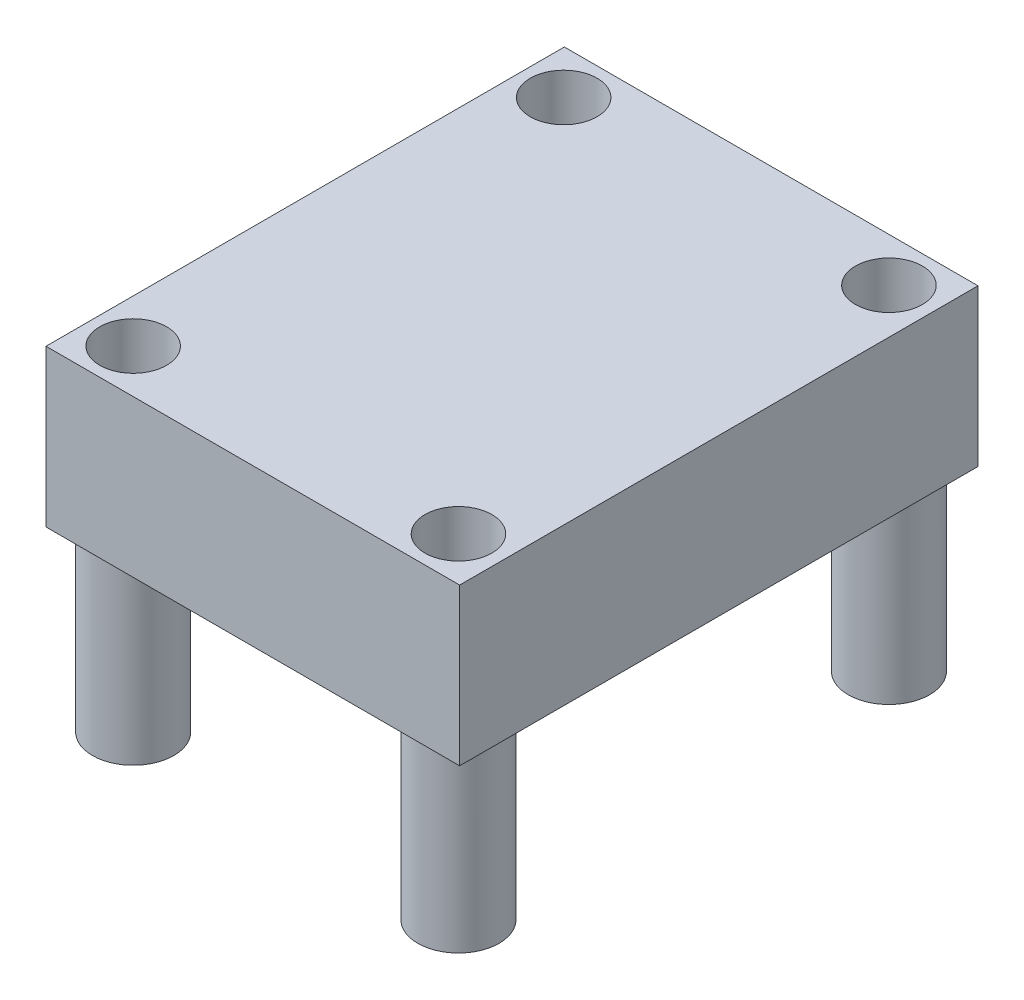
ISO-10303-21;
HEADER;
FILE_DESCRIPTION(('STEP AP214'),'2;1');
FILE_NAME('part.step','',(''),(''),'','','');
FILE_SCHEMA(('AUTOMOTIVE_DESIGN { 1 0 10303 214 1 1 1 1 }'));
ENDSEC;
DATA;
#1=APPLICATION_CONTEXT('core data for automotive mechanical design processes');
#2=APPLICATION_PROTOCOL_DEFINITION('international standard','automotive_design',2000,#1);
#3=PRODUCT_CONTEXT('',#1,'mechanical');
#4=PRODUCT('Part','Part','',(#3));
#5=PRODUCT_RELATED_PRODUCT_CATEGORY('part','',(#4));
#6=PRODUCT_DEFINITION_FORMATION('','',#4);
#7=PRODUCT_DEFINITION_CONTEXT('part definition',#1,'design');
#8=PRODUCT_DEFINITION('design','',#6,#7);
#9=PRODUCT_DEFINITION_SHAPE('','',#8);
#10=(LENGTH_UNIT() NAMED_UNIT(*) SI_UNIT(.MILLI.,.METRE.));
#11=(NAMED_UNIT(*) PLANE_ANGLE_UNIT() SI_UNIT($,.RADIAN.));
#12=(NAMED_UNIT(*) SI_UNIT($,.STERADIAN.) SOLID_ANGLE_UNIT());
#13=UNCERTAINTY_MEASURE_WITH_UNIT(LENGTH_MEASURE(1.E-05),#10,'distance_accuracy_value','');
#14=(GEOMETRIC_REPRESENTATION_CONTEXT(3) GLOBAL_UNCERTAINTY_ASSIGNED_CONTEXT((#13)) GLOBAL_UNIT_ASSIGNED_CONTEXT((#10,
#11,#12)) REPRESENTATION_CONTEXT('',''));
#15=CARTESIAN_POINT('',(0.,0.,0.));
#16=DIRECTION('',(0.,0.,1.));
#17=DIRECTION('',(1.,0.,0.));
#18=AXIS2_PLACEMENT_3D('',#15,#16,#17);
#19=CARTESIAN_POINT('',(-9.13941883767535,7.6708,-8.06299839679359));
#20=DIRECTION('',(1.,0.,0.));
#21=DIRECTION('',(0.,0.,-1.));
#22=AXIS2_PLACEMENT_3D('',#19,#20,#21);
#23=PLANE('',#22);
#24=DIRECTION('',(0.,0.,1.));
#25=VECTOR('',#24,1.);
#26=CARTESIAN_POINT('',(-9.13941883767535,0.,-8.06299839679359));
#27=LINE('',#26,#25);
#28=CARTESIAN_POINT('',(-9.13941883767535,0.,-8.06299839679359));
#29=VERTEX_POINT('',#28);
#30=CARTESIAN_POINT('',(-9.13941883767534,0.,17.3370016032064));
#31=VERTEX_POINT('',#30);
#32=EDGE_CURVE('E106',#29,#31,#27,.T.);
#33=ORIENTED_EDGE('',*,*,#32,.T.);
#34=DIRECTION('',(0.,-1.,0.));
#35=VECTOR('',#34,1.);
#36=CARTESIAN_POINT('',(-9.13941883767534,7.6708,17.3370016032064));
#37=LINE('',#36,#35);
#38=CARTESIAN_POINT('',(-9.13941883767534,7.6708,17.3370016032064));
#39=VERTEX_POINT('',#38);
#40=EDGE_CURVE('E97',#39,#31,#37,.T.);
#41=ORIENTED_EDGE('',*,*,#40,.F.);
#42=DIRECTION('',(0.,0.,1.));
#43=VECTOR('',#42,1.);
#44=CARTESIAN_POINT('',(-9.13941883767535,7.6708,-8.06299839679359));
#45=LINE('',#44,#43);
#46=CARTESIAN_POINT('',(-9.13941883767535,7.6708,-8.06299839679359));
#47=VERTEX_POINT('',#46);
#48=EDGE_CURVE('E91',#47,#39,#45,.T.);
#49=ORIENTED_EDGE('',*,*,#48,.F.);
#50=DIRECTION('',(0.,-1.,0.));
#51=VECTOR('',#50,1.);
#52=CARTESIAN_POINT('',(-9.13941883767535,7.6708,-8.06299839679359));
#53=LINE('',#52,#51);
#54=EDGE_CURVE('E102',#47,#29,#53,.T.);
#55=ORIENTED_EDGE('',*,*,#54,.T.);
#56=EDGE_LOOP('',(#33,#41,#49,#55));
#57=FACE_BOUND('',#56,.T.);
#58=ADVANCED_FACE('F39',(#57),#23,.F.);
#59=CARTESIAN_POINT('',(-9.13941883767534,7.6708,17.3370016032064));
#60=DIRECTION('',(0.,0.,-1.));
#61=DIRECTION('',(-1.,0.,0.));
#62=AXIS2_PLACEMENT_3D('',#59,#60,#61);
#63=PLANE('',#62);
#64=DIRECTION('',(1.,0.,0.));
#65=VECTOR('',#64,1.);
#66=CARTESIAN_POINT('',(-9.13941883767534,0.,17.3370016032064));
#67=LINE('',#66,#65);
#68=CARTESIAN_POINT('',(11.1297811623247,0.,17.3370016032064));
#69=VERTEX_POINT('',#68);
#70=EDGE_CURVE('E96',#31,#69,#67,.T.);
#71=ORIENTED_EDGE('',*,*,#70,.T.);
#72=DIRECTION('',(0.,-1.,0.));
#73=VECTOR('',#72,1.);
#74=CARTESIAN_POINT('',(11.1297811623247,7.6708,17.3370016032064));
#75=LINE('',#74,#73);
#76=CARTESIAN_POINT('',(11.1297811623247,7.6708,17.3370016032064));
#77=VERTEX_POINT('',#76);
#78=EDGE_CURVE('E94',#77,#69,#75,.T.);
#79=ORIENTED_EDGE('',*,*,#78,.F.);
#80=DIRECTION('',(1.,0.,0.));
#81=VECTOR('',#80,1.);
#82=CARTESIAN_POINT('',(-9.13941883767534,7.6708,17.3370016032064));
#83=LINE('',#82,#81);
#84=EDGE_CURVE('E86',#39,#77,#83,.T.);
#85=ORIENTED_EDGE('',*,*,#84,.F.);
#86=ORIENTED_EDGE('',*,*,#40,.T.);
#87=EDGE_LOOP('',(#71,#79,#85,#86));
#88=FACE_BOUND('',#87,.T.);
#89=ADVANCED_FACE('F95',(#88),#63,.F.);
#90=CARTESIAN_POINT('',(11.1297811623247,7.6708,-8.06299839679359));
#91=DIRECTION('',(-1.,0.,0.));
#92=DIRECTION('',(0.,0.,1.));
#93=AXIS2_PLACEMENT_3D('',#90,#91,#92);
#94=PLANE('',#93);
#95=DIRECTION('',(0.,0.,-1.));
#96=VECTOR('',#95,1.);
#97=CARTESIAN_POINT('',(11.1297811623247,0.,-8.06299839679359));
#98=LINE('',#97,#96);
#99=CARTESIAN_POINT('',(11.1297811623247,0.,-8.06299839679359));
#100=VERTEX_POINT('',#99);
#101=EDGE_CURVE('E72',#69,#100,#98,.T.);
#102=ORIENTED_EDGE('',*,*,#101,.T.);
#103=DIRECTION('',(0.,-1.,0.));
#104=VECTOR('',#103,1.);
#105=CARTESIAN_POINT('',(11.1297811623247,7.6708,-8.06299839679359));
#106=LINE('',#105,#104);
#107=CARTESIAN_POINT('',(11.1297811623247,7.6708,-8.06299839679359));
#108=VERTEX_POINT('',#107);
#109=EDGE_CURVE('E98',#108,#100,#106,.T.);
#110=ORIENTED_EDGE('',*,*,#109,.F.);
#111=DIRECTION('',(0.,0.,-1.));
#112=VECTOR('',#111,1.);
#113=CARTESIAN_POINT('',(11.1297811623247,7.6708,-8.06299839679359));
#114=LINE('',#113,#112);
#115=EDGE_CURVE('E89',#77,#108,#114,.T.);
#116=ORIENTED_EDGE('',*,*,#115,.F.);
#117=ORIENTED_EDGE('',*,*,#78,.T.);
#118=EDGE_LOOP('',(#102,#110,#116,#117));
#119=FACE_BOUND('',#118,.T.);
#120=ADVANCED_FACE('F100',(#119),#94,.F.);
#121=CARTESIAN_POINT('',(-9.13941883767535,7.6708,-8.06299839679359));
#122=DIRECTION('',(0.,0.,1.));
#123=DIRECTION('',(1.,0.,0.));
#124=AXIS2_PLACEMENT_3D('',#121,#122,#123);
#125=PLANE('',#124);
#126=DIRECTION('',(-1.,0.,0.));
#127=VECTOR('',#126,1.);
#128=CARTESIAN_POINT('',(-9.13941883767535,0.,-8.06299839679359));
#129=LINE('',#128,#127);
#130=EDGE_CURVE('E78',#100,#29,#129,.T.);
#131=ORIENTED_EDGE('',*,*,#130,.T.);
#132=ORIENTED_EDGE('',*,*,#54,.F.);
#133=DIRECTION('',(-1.,0.,0.));
#134=VECTOR('',#133,1.);
#135=CARTESIAN_POINT('',(-9.13941883767535,7.6708,-8.06299839679359));
#136=LINE('',#135,#134);
#137=EDGE_CURVE('E55',#108,#47,#136,.T.);
#138=ORIENTED_EDGE('',*,*,#137,.F.);
#139=ORIENTED_EDGE('',*,*,#109,.T.);
#140=EDGE_LOOP('',(#131,#132,#138,#139));
#141=FACE_BOUND('',#140,.T.);
#142=ADVANCED_FACE('F138',(#141),#125,.F.);
#143=CARTESIAN_POINT('',(0.,7.6708,0.));
#144=DIRECTION('',(0.,1.,0.));
#145=DIRECTION('',(0.,0.,1.));
#146=AXIS2_PLACEMENT_3D('',#143,#144,#145);
#147=PLANE('',#146);
#148=CARTESIAN_POINT('',(-7.01266761022166,7.6708,-5.90251142136091));
#149=DIRECTION('',(0.,1.,0.));
#150=DIRECTION('',(0.,0.,1.));
#151=AXIS2_PLACEMENT_3D('',#148,#149,#150);
#152=CIRCLE('',#151,1.6383);
#153=CARTESIAN_POINT('',(-7.01266761022166,7.6708,-4.2642114213609));
#154=VERTEX_POINT('',#153);
#155=EDGE_CURVE('E356',#154,#154,#152,.T.);
#156=ORIENTED_EDGE('',*,*,#155,.F.);
#157=EDGE_LOOP('',(#156));
#158=FACE_BOUND('',#157,.T.);
#159=CARTESIAN_POINT('',(8.92513257327033,7.6708,15.1920941000938));
#160=DIRECTION('',(0.,1.,0.));
#161=DIRECTION('',(0.,0.,1.));
#162=AXIS2_PLACEMENT_3D('',#159,#160,#161);
#163=CIRCLE('',#162,1.6383);
#164=CARTESIAN_POINT('',(8.92513257327033,7.6708,16.8303941000938));
#165=VERTEX_POINT('',#164);
#166=EDGE_CURVE('E358',#165,#165,#163,.T.);
#167=ORIENTED_EDGE('',*,*,#166,.F.);
#168=EDGE_LOOP('',(#167));
#169=FACE_BOUND('',#168,.T.);
#170=CARTESIAN_POINT('',(-7.01266761022166,7.6708,15.1920941000938));
#171=DIRECTION('',(0.,1.,0.));
#172=DIRECTION('',(0.,0.,1.));
#173=AXIS2_PLACEMENT_3D('',#170,#171,#172);
#174=CIRCLE('',#173,1.6383);
#175=CARTESIAN_POINT('',(-7.01266761022166,7.6708,16.8303941000938));
#176=VERTEX_POINT('',#175);
#177=EDGE_CURVE('E364',#176,#176,#174,.T.);
#178=ORIENTED_EDGE('',*,*,#177,.F.);
#179=EDGE_LOOP('',(#178));
#180=FACE_BOUND('',#179,.T.);
#181=CARTESIAN_POINT('',(8.92513257327033,7.6708,-5.90251142136091));
#182=DIRECTION('',(0.,1.,0.));
#183=DIRECTION('',(0.,0.,1.));
#184=AXIS2_PLACEMENT_3D('',#181,#182,#183);
#185=CIRCLE('',#184,1.6383);
#186=CARTESIAN_POINT('',(8.92513257327033,7.6708,-4.2642114213609));
#187=VERTEX_POINT('',#186);
#188=EDGE_CURVE('E357',#187,#187,#185,.T.);
#189=ORIENTED_EDGE('',*,*,#188,.F.);
#190=EDGE_LOOP('',(#189));
#191=FACE_BOUND('',#190,.T.);
#192=ORIENTED_EDGE('',*,*,#48,.T.);
#193=ORIENTED_EDGE('',*,*,#84,.T.);
#194=ORIENTED_EDGE('',*,*,#115,.T.);
#195=ORIENTED_EDGE('',*,*,#137,.T.);
#196=EDGE_LOOP('',(#192,#193,#194,#195));
#197=FACE_BOUND('',#196,.T.);
#198=ADVANCED_FACE('F87',(#158,#169,#180,#191,#197),#147,.T.);
#199=CARTESIAN_POINT('',(0.,0.,0.));
#200=DIRECTION('',(0.,1.,0.));
#201=DIRECTION('',(0.,0.,1.));
#202=AXIS2_PLACEMENT_3D('',#199,#200,#201);
#203=PLANE('',#202);
#204=CARTESIAN_POINT('',(-7.01266761022166,0.,-5.90251142136091));
#205=DIRECTION('',(0.,1.,0.));
#206=DIRECTION('',(0.,0.,1.));
#207=AXIS2_PLACEMENT_3D('',#204,#205,#206);
#208=CIRCLE('',#207,1.9939);
#209=CARTESIAN_POINT('',(-7.01266761022166,0.,-3.90861142136091));
#210=VERTEX_POINT('',#209);
#211=EDGE_CURVE('E11',#210,#210,#208,.F.);
#212=ORIENTED_EDGE('',*,*,#211,.F.);
#213=EDGE_LOOP('',(#212));
#214=FACE_BOUND('',#213,.T.);
#215=CARTESIAN_POINT('',(8.92513257327033,0.,-5.90251142136091));
#216=DIRECTION('',(0.,1.,0.));
#217=DIRECTION('',(0.,0.,1.));
#218=AXIS2_PLACEMENT_3D('',#215,#216,#217);
#219=CIRCLE('',#218,1.9939);
#220=CARTESIAN_POINT('',(8.92513257327033,0.,-3.90861142136091));
#221=VERTEX_POINT('',#220);
#222=EDGE_CURVE('E47',#221,#221,#219,.F.);
#223=ORIENTED_EDGE('',*,*,#222,.F.);
#224=EDGE_LOOP('',(#223));
#225=FACE_BOUND('',#224,.T.);
#226=CARTESIAN_POINT('',(8.92513257327033,0.,15.1920941000938));
#227=DIRECTION('',(0.,1.,0.));
#228=DIRECTION('',(0.,0.,1.));
#229=AXIS2_PLACEMENT_3D('',#226,#227,#228);
#230=CIRCLE('',#229,1.9939);
#231=CARTESIAN_POINT('',(8.92513257327033,0.,17.1859941000938));
#232=VERTEX_POINT('',#231);
#233=EDGE_CURVE('E119',#232,#232,#230,.F.);
#234=ORIENTED_EDGE('',*,*,#233,.F.);
#235=EDGE_LOOP('',(#234));
#236=FACE_BOUND('',#235,.T.);
#237=CARTESIAN_POINT('',(-7.01266761022166,0.,15.1920941000938));
#238=DIRECTION('',(0.,1.,0.));
#239=DIRECTION('',(0.,0.,1.));
#240=AXIS2_PLACEMENT_3D('',#237,#238,#239);
#241=CIRCLE('',#240,1.9939);
#242=CARTESIAN_POINT('',(-7.01266761022166,0.,17.1859941000938));
#243=VERTEX_POINT('',#242);
#244=EDGE_CURVE('E116',#243,#243,#241,.F.);
#245=ORIENTED_EDGE('',*,*,#244,.F.);
#246=EDGE_LOOP('',(#245));
#247=FACE_BOUND('',#246,.T.);
#248=ORIENTED_EDGE('',*,*,#32,.F.);
#249=ORIENTED_EDGE('',*,*,#130,.F.);
#250=ORIENTED_EDGE('',*,*,#101,.F.);
#251=ORIENTED_EDGE('',*,*,#70,.F.);
#252=EDGE_LOOP('',(#248,#249,#250,#251));
#253=FACE_BOUND('',#252,.T.);
#254=ADVANCED_FACE('F126',(#214,#225,#236,#247,#253),#203,.F.);
#255=CARTESIAN_POINT('',(-7.01266761022166,-8.7122,15.1920941000938));
#256=DIRECTION('',(0.,-1.,0.));
#257=DIRECTION('',(0.,0.,-1.));
#258=AXIS2_PLACEMENT_3D('',#255,#256,#257);
#259=PLANE('',#258);
#260=CARTESIAN_POINT('',(-7.01266761022166,-8.7122,15.1920941000938));
#261=DIRECTION('',(0.,-1.,0.));
#262=DIRECTION('',(0.,0.,-1.));
#263=AXIS2_PLACEMENT_3D('',#260,#261,#262);
#264=CIRCLE('',#263,1.9939);
#265=CARTESIAN_POINT('',(-7.01266761022166,-8.7122,13.1981941000938));
#266=VERTEX_POINT('',#265);
#267=EDGE_CURVE('E109',#266,#266,#264,.T.);
#268=ORIENTED_EDGE('',*,*,#267,.T.);
#269=EDGE_LOOP('',(#268));
#270=FACE_BOUND('',#269,.T.);
#271=CARTESIAN_POINT('',(-7.01266761022166,-8.7122,15.1920941000938));
#272=DIRECTION('',(0.,-1.,0.));
#273=DIRECTION('',(0.,0.,-1.));
#274=AXIS2_PLACEMENT_3D('',#271,#272,#273);
#275=CIRCLE('',#274,1.6383);
#276=CARTESIAN_POINT('',(-7.01266761022166,-8.7122,13.5537941000938));
#277=VERTEX_POINT('',#276);
#278=EDGE_CURVE('E383',#277,#277,#275,.T.);
#279=ORIENTED_EDGE('',*,*,#278,.F.);
#280=EDGE_LOOP('',(#279));
#281=FACE_BOUND('',#280,.T.);
#282=ADVANCED_FACE('F129',(#270,#281),#259,.T.);
#283=CARTESIAN_POINT('',(-7.01266761022166,-8.7122,15.1920941000938));
#284=DIRECTION('',(0.,1.,0.));
#285=DIRECTION('',(0.,0.,1.));
#286=AXIS2_PLACEMENT_3D('',#283,#284,#285);
#287=CYLINDRICAL_SURFACE('',#286,1.9939);
#288=ORIENTED_EDGE('',*,*,#267,.F.);
#289=EDGE_LOOP('',(#288));
#290=FACE_BOUND('',#289,.T.);
#291=ORIENTED_EDGE('',*,*,#244,.T.);
#292=EDGE_LOOP('',(#291));
#293=FACE_BOUND('',#292,.T.);
#294=ADVANCED_FACE('F181',(#290,#293),#287,.T.);
#295=CARTESIAN_POINT('',(-7.01266761022166,-8.7122,15.1920941000938));
#296=DIRECTION('',(0.,1.,0.));
#297=DIRECTION('',(0.,0.,1.));
#298=AXIS2_PLACEMENT_3D('',#295,#296,#297);
#299=CYLINDRICAL_SURFACE('',#298,1.6383);
#300=ORIENTED_EDGE('',*,*,#278,.T.);
#301=EDGE_LOOP('',(#300));
#302=FACE_BOUND('',#301,.T.);
#303=ORIENTED_EDGE('',*,*,#177,.T.);
#304=EDGE_LOOP('',(#303));
#305=FACE_BOUND('',#304,.T.);
#306=ADVANCED_FACE('F192',(#302,#305),#299,.F.);
#307=CARTESIAN_POINT('',(8.92513257327033,-8.7122,15.1920941000938));
#308=DIRECTION('',(0.,-1.,0.));
#309=DIRECTION('',(0.,0.,-1.));
#310=AXIS2_PLACEMENT_3D('',#307,#308,#309);
#311=PLANE('',#310);
#312=CARTESIAN_POINT('',(8.92513257327033,-8.7122,15.1920941000938));
#313=DIRECTION('',(0.,-1.,0.));
#314=DIRECTION('',(0.,0.,-1.));
#315=AXIS2_PLACEMENT_3D('',#312,#313,#314);
#316=CIRCLE('',#315,1.9939);
#317=CARTESIAN_POINT('',(8.92513257327033,-8.7122,13.1981941000938));
#318=VERTEX_POINT('',#317);
#319=EDGE_CURVE('E377',#318,#318,#316,.T.);
#320=ORIENTED_EDGE('',*,*,#319,.T.);
#321=EDGE_LOOP('',(#320));
#322=FACE_BOUND('',#321,.T.);
#323=CARTESIAN_POINT('',(8.92513257327033,-8.7122,15.1920941000938));
#324=DIRECTION('',(0.,-1.,0.));
#325=DIRECTION('',(0.,0.,-1.));
#326=AXIS2_PLACEMENT_3D('',#323,#324,#325);
#327=CIRCLE('',#326,1.6383);
#328=CARTESIAN_POINT('',(8.92513257327033,-8.7122,13.5537941000938));
#329=VERTEX_POINT('',#328);
#330=EDGE_CURVE('E380',#329,#329,#327,.T.);
#331=ORIENTED_EDGE('',*,*,#330,.F.);
#332=EDGE_LOOP('',(#331));
#333=FACE_BOUND('',#332,.T.);
#334=ADVANCED_FACE('F201',(#322,#333),#311,.T.);
#335=CARTESIAN_POINT('',(8.92513257327033,-8.7122,15.1920941000938));
#336=DIRECTION('',(0.,1.,0.));
#337=DIRECTION('',(0.,0.,1.));
#338=AXIS2_PLACEMENT_3D('',#335,#336,#337);
#339=CYLINDRICAL_SURFACE('',#338,1.9939);
#340=ORIENTED_EDGE('',*,*,#319,.F.);
#341=EDGE_LOOP('',(#340));
#342=FACE_BOUND('',#341,.T.);
#343=ORIENTED_EDGE('',*,*,#233,.T.);
#344=EDGE_LOOP('',(#343));
#345=FACE_BOUND('',#344,.T.);
#346=ADVANCED_FACE('F206',(#342,#345),#339,.T.);
#347=CARTESIAN_POINT('',(8.92513257327033,-8.7122,15.1920941000938));
#348=DIRECTION('',(0.,1.,0.));
#349=DIRECTION('',(0.,0.,1.));
#350=AXIS2_PLACEMENT_3D('',#347,#348,#349);
#351=CYLINDRICAL_SURFACE('',#350,1.6383);
#352=ORIENTED_EDGE('',*,*,#330,.T.);
#353=EDGE_LOOP('',(#352));
#354=FACE_BOUND('',#353,.T.);
#355=ORIENTED_EDGE('',*,*,#166,.T.);
#356=EDGE_LOOP('',(#355));
#357=FACE_BOUND('',#356,.T.);
#358=ADVANCED_FACE('F217',(#354,#357),#351,.F.);
#359=CARTESIAN_POINT('',(8.92513257327033,-8.7122,-5.90251142136091));
#360=DIRECTION('',(0.,-1.,0.));
#361=DIRECTION('',(0.,0.,-1.));
#362=AXIS2_PLACEMENT_3D('',#359,#360,#361);
#363=PLANE('',#362);
#364=CARTESIAN_POINT('',(8.92513257327033,-8.7122,-5.90251142136091));
#365=DIRECTION('',(0.,-1.,0.));
#366=DIRECTION('',(0.,0.,-1.));
#367=AXIS2_PLACEMENT_3D('',#364,#365,#366);
#368=CIRCLE('',#367,1.9939);
#369=CARTESIAN_POINT('',(8.92513257327033,-8.7122,-7.8964114213609));
#370=VERTEX_POINT('',#369);
#371=EDGE_CURVE('E371',#370,#370,#368,.T.);
#372=ORIENTED_EDGE('',*,*,#371,.T.);
#373=EDGE_LOOP('',(#372));
#374=FACE_BOUND('',#373,.T.);
#375=CARTESIAN_POINT('',(8.92513257327033,-8.7122,-5.90251142136091));
#376=DIRECTION('',(0.,-1.,0.));
#377=DIRECTION('',(0.,0.,-1.));
#378=AXIS2_PLACEMENT_3D('',#375,#376,#377);
#379=CIRCLE('',#378,1.6383);
#380=CARTESIAN_POINT('',(8.92513257327033,-8.7122,-7.54081142136091));
#381=VERTEX_POINT('',#380);
#382=EDGE_CURVE('E374',#381,#381,#379,.T.);
#383=ORIENTED_EDGE('',*,*,#382,.F.);
#384=EDGE_LOOP('',(#383));
#385=FACE_BOUND('',#384,.T.);
#386=ADVANCED_FACE('F226',(#374,#385),#363,.T.);
#387=CARTESIAN_POINT('',(8.92513257327033,-8.7122,-5.90251142136091));
#388=DIRECTION('',(0.,1.,0.));
#389=DIRECTION('',(0.,0.,1.));
#390=AXIS2_PLACEMENT_3D('',#387,#388,#389);
#391=CYLINDRICAL_SURFACE('',#390,1.9939);
#392=ORIENTED_EDGE('',*,*,#371,.F.);
#393=EDGE_LOOP('',(#392));
#394=FACE_BOUND('',#393,.T.);
#395=ORIENTED_EDGE('',*,*,#222,.T.);
#396=EDGE_LOOP('',(#395));
#397=FACE_BOUND('',#396,.T.);
#398=ADVANCED_FACE('F124',(#394,#397),#391,.T.);
#399=CARTESIAN_POINT('',(8.92513257327033,-8.7122,-5.90251142136091));
#400=DIRECTION('',(0.,1.,0.));
#401=DIRECTION('',(0.,0.,1.));
#402=AXIS2_PLACEMENT_3D('',#399,#400,#401);
#403=CYLINDRICAL_SURFACE('',#402,1.6383);
#404=ORIENTED_EDGE('',*,*,#382,.T.);
#405=EDGE_LOOP('',(#404));
#406=FACE_BOUND('',#405,.T.);
#407=ORIENTED_EDGE('',*,*,#188,.T.);
#408=EDGE_LOOP('',(#407));
#409=FACE_BOUND('',#408,.T.);
#410=ADVANCED_FACE('F241',(#406,#409),#403,.F.);
#411=CARTESIAN_POINT('',(-7.01266761022166,-8.7122,-5.90251142136091));
#412=DIRECTION('',(0.,-1.,0.));
#413=DIRECTION('',(0.,0.,-1.));
#414=AXIS2_PLACEMENT_3D('',#411,#412,#413);
#415=PLANE('',#414);
#416=CARTESIAN_POINT('',(-7.01266761022166,-8.7122,-5.90251142136091));
#417=DIRECTION('',(0.,-1.,0.));
#418=DIRECTION('',(0.,0.,-1.));
#419=AXIS2_PLACEMENT_3D('',#416,#417,#418);
#420=CIRCLE('',#419,1.9939);
#421=CARTESIAN_POINT('',(-7.01266761022166,-8.7122,-7.8964114213609));
#422=VERTEX_POINT('',#421);
#423=EDGE_CURVE('E361',#422,#422,#420,.T.);
#424=ORIENTED_EDGE('',*,*,#423,.T.);
#425=EDGE_LOOP('',(#424));
#426=FACE_BOUND('',#425,.T.);
#427=CARTESIAN_POINT('',(-7.01266761022166,-8.7122,-5.90251142136091));
#428=DIRECTION('',(0.,-1.,0.));
#429=DIRECTION('',(0.,0.,-1.));
#430=AXIS2_PLACEMENT_3D('',#427,#428,#429);
#431=CIRCLE('',#430,1.6383);
#432=CARTESIAN_POINT('',(-7.01266761022166,-8.7122,-7.54081142136091));
#433=VERTEX_POINT('',#432);
#434=EDGE_CURVE('E353',#433,#433,#431,.T.);
#435=ORIENTED_EDGE('',*,*,#434,.F.);
#436=EDGE_LOOP('',(#435));
#437=FACE_BOUND('',#436,.T.);
#438=ADVANCED_FACE('F250',(#426,#437),#415,.T.);
#439=CARTESIAN_POINT('',(-7.01266761022166,-8.7122,-5.90251142136091));
#440=DIRECTION('',(0.,1.,0.));
#441=DIRECTION('',(0.,0.,1.));
#442=AXIS2_PLACEMENT_3D('',#439,#440,#441);
#443=CYLINDRICAL_SURFACE('',#442,1.9939);
#444=ORIENTED_EDGE('',*,*,#423,.F.);
#445=EDGE_LOOP('',(#444));
#446=FACE_BOUND('',#445,.T.);
#447=ORIENTED_EDGE('',*,*,#211,.T.);
#448=EDGE_LOOP('',(#447));
#449=FACE_BOUND('',#448,.T.);
#450=ADVANCED_FACE('F255',(#446,#449),#443,.T.);
#451=CARTESIAN_POINT('',(-7.01266761022166,-8.7122,-5.90251142136091));
#452=DIRECTION('',(0.,1.,0.));
#453=DIRECTION('',(0.,0.,1.));
#454=AXIS2_PLACEMENT_3D('',#451,#452,#453);
#455=CYLINDRICAL_SURFACE('',#454,1.6383);
#456=ORIENTED_EDGE('',*,*,#434,.T.);
#457=EDGE_LOOP('',(#456));
#458=FACE_BOUND('',#457,.T.);
#459=ORIENTED_EDGE('',*,*,#155,.T.);
#460=EDGE_LOOP('',(#459));
#461=FACE_BOUND('',#460,.T.);
#462=ADVANCED_FACE('F266',(#458,#461),#455,.F.);
#463=CLOSED_SHELL('',(#58,#89,#120,#142,#198,#254,#282,#294,#306,#334,#346,#358,#386,#398,#410,
#438,#450,#462));
#464=MANIFOLD_SOLID_BREP('B2',#463);
#465=ADVANCED_BREP_SHAPE_REPRESENTATION('',(#18,#464),#14);
#466=SHAPE_DEFINITION_REPRESENTATION(#9,#465);
ENDSEC;
END-ISO-10303-21;
